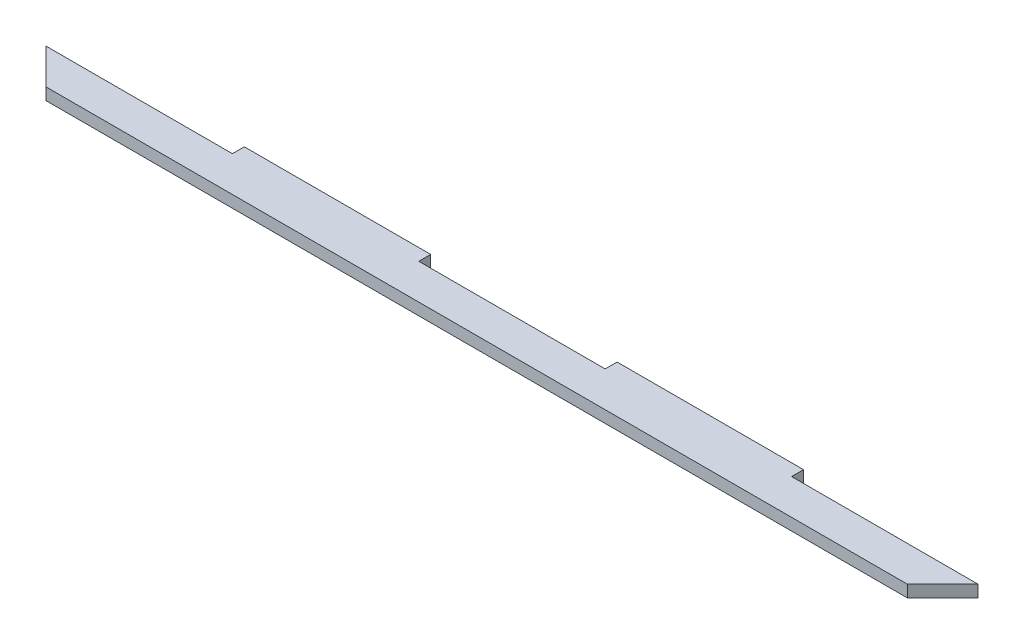
ISO-10303-21;
HEADER;
FILE_DESCRIPTION(('STEP AP214'),'2;1');
FILE_NAME('part.step','',(''),(''),'','','');
FILE_SCHEMA(('AUTOMOTIVE_DESIGN { 1 0 10303 214 1 1 1 1 }'));
ENDSEC;
DATA;
#1=APPLICATION_CONTEXT('core data for automotive mechanical design processes');
#2=APPLICATION_PROTOCOL_DEFINITION('international standard','automotive_design',2000,#1);
#3=PRODUCT_CONTEXT('',#1,'mechanical');
#4=PRODUCT('Part','Part','',(#3));
#5=PRODUCT_RELATED_PRODUCT_CATEGORY('part','',(#4));
#6=PRODUCT_DEFINITION_FORMATION('','',#4);
#7=PRODUCT_DEFINITION_CONTEXT('part definition',#1,'design');
#8=PRODUCT_DEFINITION('design','',#6,#7);
#9=PRODUCT_DEFINITION_SHAPE('','',#8);
#10=(LENGTH_UNIT() NAMED_UNIT(*) SI_UNIT(.MILLI.,.METRE.));
#11=(NAMED_UNIT(*) PLANE_ANGLE_UNIT() SI_UNIT($,.RADIAN.));
#12=(NAMED_UNIT(*) SI_UNIT($,.STERADIAN.) SOLID_ANGLE_UNIT());
#13=UNCERTAINTY_MEASURE_WITH_UNIT(LENGTH_MEASURE(1.E-05),#10,'distance_accuracy_value','');
#14=(GEOMETRIC_REPRESENTATION_CONTEXT(3) GLOBAL_UNCERTAINTY_ASSIGNED_CONTEXT((#13)) GLOBAL_UNIT_ASSIGNED_CONTEXT((#10,
#11,#12)) REPRESENTATION_CONTEXT('',''));
#15=CARTESIAN_POINT('',(0.,0.,0.));
#16=DIRECTION('',(0.,0.,1.));
#17=DIRECTION('',(1.,0.,0.));
#18=AXIS2_PLACEMENT_3D('',#15,#16,#17);
#19=CARTESIAN_POINT('',(5.1686956521739,2.7,-5.43571484255049));
#20=DIRECTION('',(1.,0.,0.));
#21=DIRECTION('',(0.,0.,-1.));
#22=AXIS2_PLACEMENT_3D('',#19,#20,#21);
#23=PLANE('',#22);
#24=DIRECTION('',(0.,0.,1.));
#25=VECTOR('',#24,1.);
#26=CARTESIAN_POINT('',(5.1686956521739,0.,-5.43571484255049));
#27=LINE('',#26,#25);
#28=CARTESIAN_POINT('',(5.1686956521739,0.,-5.43571484255049));
#29=VERTEX_POINT('',#28);
#30=CARTESIAN_POINT('',(5.1686956521739,0.,-2.73571484255049));
#31=VERTEX_POINT('',#30);
#32=EDGE_CURVE('E153',#29,#31,#27,.T.);
#33=ORIENTED_EDGE('',*,*,#32,.T.);
#34=DIRECTION('',(0.,-1.,0.));
#35=VECTOR('',#34,1.);
#36=CARTESIAN_POINT('',(5.1686956521739,2.7,-2.73571484255049));
#37=LINE('',#36,#35);
#38=CARTESIAN_POINT('',(5.1686956521739,2.7,-2.73571484255049));
#39=VERTEX_POINT('',#38);
#40=EDGE_CURVE('E11',#39,#31,#37,.T.);
#41=ORIENTED_EDGE('',*,*,#40,.F.);
#42=DIRECTION('',(0.,0.,1.));
#43=VECTOR('',#42,1.);
#44=CARTESIAN_POINT('',(5.1686956521739,2.7,-5.43571484255049));
#45=LINE('',#44,#43);
#46=CARTESIAN_POINT('',(5.1686956521739,2.7,-5.43571484255049));
#47=VERTEX_POINT('',#46);
#48=EDGE_CURVE('E175',#47,#39,#45,.T.);
#49=ORIENTED_EDGE('',*,*,#48,.F.);
#50=DIRECTION('',(0.,-1.,0.));
#51=VECTOR('',#50,1.);
#52=CARTESIAN_POINT('',(5.1686956521739,2.7,-5.43571484255049));
#53=LINE('',#52,#51);
#54=EDGE_CURVE('E149',#47,#29,#53,.T.);
#55=ORIENTED_EDGE('',*,*,#54,.T.);
#56=EDGE_LOOP('',(#33,#41,#49,#55));
#57=FACE_BOUND('',#56,.T.);
#58=ADVANCED_FACE('F33',(#57),#23,.F.);
#59=CARTESIAN_POINT('',(-37.0313043478261,2.7,-2.73571484255049));
#60=DIRECTION('',(0.,0.,1.));
#61=DIRECTION('',(1.,0.,0.));
#62=AXIS2_PLACEMENT_3D('',#59,#60,#61);
#63=PLANE('',#62);
#64=DIRECTION('',(-1.,0.,0.));
#65=VECTOR('',#64,1.);
#66=CARTESIAN_POINT('',(-37.0313043478261,0.,-2.73571484255049));
#67=LINE('',#66,#65);
#68=CARTESIAN_POINT('',(-37.0313043478261,0.,-2.73571484255049));
#69=VERTEX_POINT('',#68);
#70=EDGE_CURVE('E156',#31,#69,#67,.T.);
#71=ORIENTED_EDGE('',*,*,#70,.T.);
#72=DIRECTION('',(0.,-1.,0.));
#73=VECTOR('',#72,1.);
#74=CARTESIAN_POINT('',(-37.0313043478261,2.7,-2.73571484255049));
#75=LINE('',#74,#73);
#76=CARTESIAN_POINT('',(-37.0313043478261,2.7,-2.73571484255049));
#77=VERTEX_POINT('',#76);
#78=EDGE_CURVE('E41',#77,#69,#75,.T.);
#79=ORIENTED_EDGE('',*,*,#78,.F.);
#80=DIRECTION('',(-1.,0.,0.));
#81=VECTOR('',#80,1.);
#82=CARTESIAN_POINT('',(-37.0313043478261,2.7,-2.73571484255049));
#83=LINE('',#82,#81);
#84=EDGE_CURVE('E104',#39,#77,#83,.T.);
#85=ORIENTED_EDGE('',*,*,#84,.F.);
#86=ORIENTED_EDGE('',*,*,#40,.T.);
#87=EDGE_LOOP('',(#71,#79,#85,#86));
#88=FACE_BOUND('',#87,.T.);
#89=ADVANCED_FACE('F253',(#88),#63,.F.);
#90=CARTESIAN_POINT('',(-37.0313043478261,2.7,-2.73571484255049));
#91=DIRECTION('',(0.707106781186539,0.,-0.707106781186556));
#92=DIRECTION('',(-0.707106781186556,0.,-0.707106781186539));
#93=AXIS2_PLACEMENT_3D('',#90,#91,#92);
#94=PLANE('',#93);
#95=DIRECTION('',(0.707106781186556,0.,0.707106781186539));
#96=VECTOR('',#95,1.);
#97=CARTESIAN_POINT('',(-37.0313043478261,0.,-2.73571484255049));
#98=LINE('',#97,#96);
#99=CARTESIAN_POINT('',(-29.0313043478259,0.,5.26428515744951));
#100=VERTEX_POINT('',#99);
#101=EDGE_CURVE('E158',#69,#100,#98,.T.);
#102=ORIENTED_EDGE('',*,*,#101,.T.);
#103=DIRECTION('',(0.,-1.,0.));
#104=VECTOR('',#103,1.);
#105=CARTESIAN_POINT('',(-29.0313043478259,2.7,5.26428515744951));
#106=LINE('',#105,#104);
#107=CARTESIAN_POINT('',(-29.0313043478259,2.7,5.26428515744951));
#108=VERTEX_POINT('',#107);
#109=EDGE_CURVE('E194',#108,#100,#106,.T.);
#110=ORIENTED_EDGE('',*,*,#109,.F.);
#111=DIRECTION('',(0.707106781186556,0.,0.707106781186539));
#112=VECTOR('',#111,1.);
#113=CARTESIAN_POINT('',(-37.0313043478261,2.7,-2.73571484255049));
#114=LINE('',#113,#112);
#115=EDGE_CURVE('E202',#77,#108,#114,.T.);
#116=ORIENTED_EDGE('',*,*,#115,.F.);
#117=ORIENTED_EDGE('',*,*,#78,.T.);
#118=EDGE_LOOP('',(#102,#110,#116,#117));
#119=FACE_BOUND('',#118,.T.);
#120=ADVANCED_FACE('F200',(#119),#94,.F.);
#121=CARTESIAN_POINT('',(-29.0313043478259,2.7,5.26428515744951));
#122=DIRECTION('',(0.,0.,-1.));
#123=DIRECTION('',(-1.,0.,0.));
#124=AXIS2_PLACEMENT_3D('',#121,#122,#123);
#125=PLANE('',#124);
#126=DIRECTION('',(1.,0.,0.));
#127=VECTOR('',#126,1.);
#128=CARTESIAN_POINT('',(-29.0313043478259,0.,5.26428515744951));
#129=LINE('',#128,#127);
#130=CARTESIAN_POINT('',(165.968695652174,0.,5.26428515744952));
#131=VERTEX_POINT('',#130);
#132=EDGE_CURVE('E160',#100,#131,#129,.T.);
#133=ORIENTED_EDGE('',*,*,#132,.T.);
#134=DIRECTION('',(0.,-1.,0.));
#135=VECTOR('',#134,1.);
#136=CARTESIAN_POINT('',(165.968695652174,2.7,5.26428515744952));
#137=LINE('',#136,#135);
#138=CARTESIAN_POINT('',(165.968695652174,2.7,5.26428515744952));
#139=VERTEX_POINT('',#138);
#140=EDGE_CURVE('E191',#139,#131,#137,.T.);
#141=ORIENTED_EDGE('',*,*,#140,.F.);
#142=DIRECTION('',(1.,0.,0.));
#143=VECTOR('',#142,1.);
#144=CARTESIAN_POINT('',(-29.0313043478259,2.7,5.26428515744951));
#145=LINE('',#144,#143);
#146=EDGE_CURVE('E220',#108,#139,#145,.T.);
#147=ORIENTED_EDGE('',*,*,#146,.F.);
#148=ORIENTED_EDGE('',*,*,#109,.T.);
#149=EDGE_LOOP('',(#133,#141,#147,#148));
#150=FACE_BOUND('',#149,.T.);
#151=ADVANCED_FACE('F211',(#150),#125,.F.);
#152=CARTESIAN_POINT('',(173.968695652174,2.7,-2.73571484255049));
#153=DIRECTION('',(-0.707106781186554,0.,-0.707106781186541));
#154=DIRECTION('',(-0.707106781186541,0.,0.707106781186554));
#155=AXIS2_PLACEMENT_3D('',#152,#153,#154);
#156=PLANE('',#155);
#157=DIRECTION('',(0.707106781186541,0.,-0.707106781186554));
#158=VECTOR('',#157,1.);
#159=CARTESIAN_POINT('',(173.968695652174,0.,-2.73571484255049));
#160=LINE('',#159,#158);
#161=CARTESIAN_POINT('',(173.968695652174,0.,-2.73571484255049));
#162=VERTEX_POINT('',#161);
#163=EDGE_CURVE('E162',#131,#162,#160,.T.);
#164=ORIENTED_EDGE('',*,*,#163,.T.);
#165=DIRECTION('',(0.,-1.,0.));
#166=VECTOR('',#165,1.);
#167=CARTESIAN_POINT('',(173.968695652174,2.7,-2.73571484255049));
#168=LINE('',#167,#166);
#169=CARTESIAN_POINT('',(173.968695652174,2.7,-2.73571484255049));
#170=VERTEX_POINT('',#169);
#171=EDGE_CURVE('E188',#170,#162,#168,.T.);
#172=ORIENTED_EDGE('',*,*,#171,.F.);
#173=DIRECTION('',(0.707106781186541,0.,-0.707106781186554));
#174=VECTOR('',#173,1.);
#175=CARTESIAN_POINT('',(173.968695652174,2.7,-2.73571484255049));
#176=LINE('',#175,#174);
#177=EDGE_CURVE('E217',#139,#170,#176,.T.);
#178=ORIENTED_EDGE('',*,*,#177,.F.);
#179=ORIENTED_EDGE('',*,*,#140,.T.);
#180=EDGE_LOOP('',(#164,#172,#178,#179));
#181=FACE_BOUND('',#180,.T.);
#182=ADVANCED_FACE('F215',(#181),#156,.F.);
#183=CARTESIAN_POINT('',(131.768695652174,2.7,-2.73571484255049));
#184=DIRECTION('',(0.,0.,1.));
#185=DIRECTION('',(1.,0.,0.));
#186=AXIS2_PLACEMENT_3D('',#183,#184,#185);
#187=PLANE('',#186);
#188=DIRECTION('',(-1.,0.,0.));
#189=VECTOR('',#188,1.);
#190=CARTESIAN_POINT('',(131.768695652174,0.,-2.73571484255049));
#191=LINE('',#190,#189);
#192=CARTESIAN_POINT('',(131.768695652174,0.,-2.73571484255049));
#193=VERTEX_POINT('',#192);
#194=EDGE_CURVE('E164',#162,#193,#191,.T.);
#195=ORIENTED_EDGE('',*,*,#194,.T.);
#196=DIRECTION('',(0.,-1.,0.));
#197=VECTOR('',#196,1.);
#198=CARTESIAN_POINT('',(131.768695652174,2.7,-2.73571484255049));
#199=LINE('',#198,#197);
#200=CARTESIAN_POINT('',(131.768695652174,2.7,-2.73571484255049));
#201=VERTEX_POINT('',#200);
#202=EDGE_CURVE('E185',#201,#193,#199,.T.);
#203=ORIENTED_EDGE('',*,*,#202,.F.);
#204=DIRECTION('',(-1.,0.,0.));
#205=VECTOR('',#204,1.);
#206=CARTESIAN_POINT('',(131.768695652174,2.7,-2.73571484255049));
#207=LINE('',#206,#205);
#208=EDGE_CURVE('E219',#170,#201,#207,.T.);
#209=ORIENTED_EDGE('',*,*,#208,.F.);
#210=ORIENTED_EDGE('',*,*,#171,.T.);
#211=EDGE_LOOP('',(#195,#203,#209,#210));
#212=FACE_BOUND('',#211,.T.);
#213=ADVANCED_FACE('F266',(#212),#187,.F.);
#214=CARTESIAN_POINT('',(131.768695652174,2.7,-5.43571484255049));
#215=DIRECTION('',(-1.,0.,0.));
#216=DIRECTION('',(0.,0.,1.));
#217=AXIS2_PLACEMENT_3D('',#214,#215,#216);
#218=PLANE('',#217);
#219=DIRECTION('',(0.,0.,-1.));
#220=VECTOR('',#219,1.);
#221=CARTESIAN_POINT('',(131.768695652174,0.,-5.43571484255049));
#222=LINE('',#221,#220);
#223=CARTESIAN_POINT('',(131.768695652174,0.,-5.43571484255049));
#224=VERTEX_POINT('',#223);
#225=EDGE_CURVE('E166',#193,#224,#222,.T.);
#226=ORIENTED_EDGE('',*,*,#225,.T.);
#227=DIRECTION('',(0.,-1.,0.));
#228=VECTOR('',#227,1.);
#229=CARTESIAN_POINT('',(131.768695652174,2.7,-5.43571484255049));
#230=LINE('',#229,#228);
#231=CARTESIAN_POINT('',(131.768695652174,2.7,-5.43571484255049));
#232=VERTEX_POINT('',#231);
#233=EDGE_CURVE('E182',#232,#224,#230,.T.);
#234=ORIENTED_EDGE('',*,*,#233,.F.);
#235=DIRECTION('',(0.,0.,-1.));
#236=VECTOR('',#235,1.);
#237=CARTESIAN_POINT('',(131.768695652174,2.7,-5.43571484255049));
#238=LINE('',#237,#236);
#239=EDGE_CURVE('E222',#201,#232,#238,.T.);
#240=ORIENTED_EDGE('',*,*,#239,.F.);
#241=ORIENTED_EDGE('',*,*,#202,.T.);
#242=EDGE_LOOP('',(#226,#234,#240,#241));
#243=FACE_BOUND('',#242,.T.);
#244=ADVANCED_FACE('F269',(#243),#218,.F.);
#245=CARTESIAN_POINT('',(89.5686956521739,2.7,-5.43571484255049));
#246=DIRECTION('',(0.,0.,1.));
#247=DIRECTION('',(1.,0.,0.));
#248=AXIS2_PLACEMENT_3D('',#245,#246,#247);
#249=PLANE('',#248);
#250=DIRECTION('',(-1.,0.,0.));
#251=VECTOR('',#250,1.);
#252=CARTESIAN_POINT('',(89.5686956521739,0.,-5.43571484255049));
#253=LINE('',#252,#251);
#254=CARTESIAN_POINT('',(89.5686956521739,0.,-5.43571484255049));
#255=VERTEX_POINT('',#254);
#256=EDGE_CURVE('E168',#224,#255,#253,.T.);
#257=ORIENTED_EDGE('',*,*,#256,.T.);
#258=DIRECTION('',(0.,-1.,0.));
#259=VECTOR('',#258,1.);
#260=CARTESIAN_POINT('',(89.5686956521739,2.7,-5.43571484255049));
#261=LINE('',#260,#259);
#262=CARTESIAN_POINT('',(89.5686956521739,2.7,-5.43571484255049));
#263=VERTEX_POINT('',#262);
#264=EDGE_CURVE('E179',#263,#255,#261,.T.);
#265=ORIENTED_EDGE('',*,*,#264,.F.);
#266=DIRECTION('',(-1.,0.,0.));
#267=VECTOR('',#266,1.);
#268=CARTESIAN_POINT('',(89.5686956521739,2.7,-5.43571484255049));
#269=LINE('',#268,#267);
#270=EDGE_CURVE('E228',#232,#263,#269,.T.);
#271=ORIENTED_EDGE('',*,*,#270,.F.);
#272=ORIENTED_EDGE('',*,*,#233,.T.);
#273=EDGE_LOOP('',(#257,#265,#271,#272));
#274=FACE_BOUND('',#273,.T.);
#275=ADVANCED_FACE('F234',(#274),#249,.F.);
#276=CARTESIAN_POINT('',(89.5686956521739,2.7,-5.43571484255049));
#277=DIRECTION('',(1.,0.,0.));
#278=DIRECTION('',(0.,0.,-1.));
#279=AXIS2_PLACEMENT_3D('',#276,#277,#278);
#280=PLANE('',#279);
#281=DIRECTION('',(0.,0.,1.));
#282=VECTOR('',#281,1.);
#283=CARTESIAN_POINT('',(89.5686956521739,0.,-5.43571484255049));
#284=LINE('',#283,#282);
#285=CARTESIAN_POINT('',(89.5686956521739,0.,-2.73571484255049));
#286=VERTEX_POINT('',#285);
#287=EDGE_CURVE('E170',#255,#286,#284,.T.);
#288=ORIENTED_EDGE('',*,*,#287,.T.);
#289=DIRECTION('',(0.,-1.,0.));
#290=VECTOR('',#289,1.);
#291=CARTESIAN_POINT('',(89.5686956521739,2.7,-2.73571484255049));
#292=LINE('',#291,#290);
#293=CARTESIAN_POINT('',(89.5686956521739,2.7,-2.73571484255049));
#294=VERTEX_POINT('',#293);
#295=EDGE_CURVE('E144',#294,#286,#292,.T.);
#296=ORIENTED_EDGE('',*,*,#295,.F.);
#297=DIRECTION('',(0.,0.,1.));
#298=VECTOR('',#297,1.);
#299=CARTESIAN_POINT('',(89.5686956521739,2.7,-5.43571484255049));
#300=LINE('',#299,#298);
#301=EDGE_CURVE('E135',#263,#294,#300,.T.);
#302=ORIENTED_EDGE('',*,*,#301,.F.);
#303=ORIENTED_EDGE('',*,*,#264,.T.);
#304=EDGE_LOOP('',(#288,#296,#302,#303));
#305=FACE_BOUND('',#304,.T.);
#306=ADVANCED_FACE('F238',(#305),#280,.F.);
#307=CARTESIAN_POINT('',(47.3686956521739,2.7,-2.73571484255049));
#308=DIRECTION('',(0.,0.,1.));
#309=DIRECTION('',(1.,0.,0.));
#310=AXIS2_PLACEMENT_3D('',#307,#308,#309);
#311=PLANE('',#310);
#312=DIRECTION('',(-1.,0.,0.));
#313=VECTOR('',#312,1.);
#314=CARTESIAN_POINT('',(47.3686956521739,0.,-2.73571484255049));
#315=LINE('',#314,#313);
#316=CARTESIAN_POINT('',(47.3686956521739,0.,-2.73571484255049));
#317=VERTEX_POINT('',#316);
#318=EDGE_CURVE('E143',#286,#317,#315,.T.);
#319=ORIENTED_EDGE('',*,*,#318,.T.);
#320=DIRECTION('',(0.,-1.,0.));
#321=VECTOR('',#320,1.);
#322=CARTESIAN_POINT('',(47.3686956521739,2.7,-2.73571484255049));
#323=LINE('',#322,#321);
#324=CARTESIAN_POINT('',(47.3686956521739,2.7,-2.73571484255049));
#325=VERTEX_POINT('',#324);
#326=EDGE_CURVE('E140',#325,#317,#323,.T.);
#327=ORIENTED_EDGE('',*,*,#326,.F.);
#328=DIRECTION('',(-1.,0.,0.));
#329=VECTOR('',#328,1.);
#330=CARTESIAN_POINT('',(47.3686956521739,2.7,-2.73571484255049));
#331=LINE('',#330,#329);
#332=EDGE_CURVE('E129',#294,#325,#331,.T.);
#333=ORIENTED_EDGE('',*,*,#332,.F.);
#334=ORIENTED_EDGE('',*,*,#295,.T.);
#335=EDGE_LOOP('',(#319,#327,#333,#334));
#336=FACE_BOUND('',#335,.T.);
#337=ADVANCED_FACE('F141',(#336),#311,.F.);
#338=CARTESIAN_POINT('',(47.3686956521739,2.7,-5.43571484255049));
#339=DIRECTION('',(-1.,0.,0.));
#340=DIRECTION('',(0.,0.,1.));
#341=AXIS2_PLACEMENT_3D('',#338,#339,#340);
#342=PLANE('',#341);
#343=DIRECTION('',(0.,0.,-1.));
#344=VECTOR('',#343,1.);
#345=CARTESIAN_POINT('',(47.3686956521739,0.,-5.43571484255049));
#346=LINE('',#345,#344);
#347=CARTESIAN_POINT('',(47.3686956521739,0.,-5.43571484255049));
#348=VERTEX_POINT('',#347);
#349=EDGE_CURVE('E90',#317,#348,#346,.T.);
#350=ORIENTED_EDGE('',*,*,#349,.T.);
#351=DIRECTION('',(0.,-1.,0.));
#352=VECTOR('',#351,1.);
#353=CARTESIAN_POINT('',(47.3686956521739,2.7,-5.43571484255049));
#354=LINE('',#353,#352);
#355=CARTESIAN_POINT('',(47.3686956521739,2.7,-5.43571484255049));
#356=VERTEX_POINT('',#355);
#357=EDGE_CURVE('E145',#356,#348,#354,.T.);
#358=ORIENTED_EDGE('',*,*,#357,.F.);
#359=DIRECTION('',(0.,0.,-1.));
#360=VECTOR('',#359,1.);
#361=CARTESIAN_POINT('',(47.3686956521739,2.7,-5.43571484255049));
#362=LINE('',#361,#360);
#363=EDGE_CURVE('E133',#325,#356,#362,.T.);
#364=ORIENTED_EDGE('',*,*,#363,.F.);
#365=ORIENTED_EDGE('',*,*,#326,.T.);
#366=EDGE_LOOP('',(#350,#358,#364,#365));
#367=FACE_BOUND('',#366,.T.);
#368=ADVANCED_FACE('F147',(#367),#342,.F.);
#369=CARTESIAN_POINT('',(5.1686956521739,2.7,-5.43571484255049));
#370=DIRECTION('',(0.,0.,1.));
#371=DIRECTION('',(1.,0.,0.));
#372=AXIS2_PLACEMENT_3D('',#369,#370,#371);
#373=PLANE('',#372);
#374=DIRECTION('',(-1.,0.,0.));
#375=VECTOR('',#374,1.);
#376=CARTESIAN_POINT('',(5.1686956521739,0.,-5.43571484255049));
#377=LINE('',#376,#375);
#378=EDGE_CURVE('E96',#348,#29,#377,.T.);
#379=ORIENTED_EDGE('',*,*,#378,.T.);
#380=ORIENTED_EDGE('',*,*,#54,.F.);
#381=DIRECTION('',(-1.,0.,0.));
#382=VECTOR('',#381,1.);
#383=CARTESIAN_POINT('',(5.1686956521739,2.7,-5.43571484255049));
#384=LINE('',#383,#382);
#385=EDGE_CURVE('E49',#356,#47,#384,.T.);
#386=ORIENTED_EDGE('',*,*,#385,.F.);
#387=ORIENTED_EDGE('',*,*,#357,.T.);
#388=EDGE_LOOP('',(#379,#380,#386,#387));
#389=FACE_BOUND('',#388,.T.);
#390=ADVANCED_FACE('F242',(#389),#373,.F.);
#391=CARTESIAN_POINT('',(0.,2.7,0.));
#392=DIRECTION('',(0.,1.,0.));
#393=DIRECTION('',(0.,0.,1.));
#394=AXIS2_PLACEMENT_3D('',#391,#392,#393);
#395=PLANE('',#394);
#396=ORIENTED_EDGE('',*,*,#48,.T.);
#397=ORIENTED_EDGE('',*,*,#84,.T.);
#398=ORIENTED_EDGE('',*,*,#115,.T.);
#399=ORIENTED_EDGE('',*,*,#146,.T.);
#400=ORIENTED_EDGE('',*,*,#177,.T.);
#401=ORIENTED_EDGE('',*,*,#208,.T.);
#402=ORIENTED_EDGE('',*,*,#239,.T.);
#403=ORIENTED_EDGE('',*,*,#270,.T.);
#404=ORIENTED_EDGE('',*,*,#301,.T.);
#405=ORIENTED_EDGE('',*,*,#332,.T.);
#406=ORIENTED_EDGE('',*,*,#363,.T.);
#407=ORIENTED_EDGE('',*,*,#385,.T.);
#408=EDGE_LOOP('',(#396,#397,#398,#399,#400,#401,#402,#403,#404,#405,#406,#407));
#409=FACE_BOUND('',#408,.T.);
#410=ADVANCED_FACE('F131',(#409),#395,.T.);
#411=CARTESIAN_POINT('',(0.,0.,0.));
#412=DIRECTION('',(0.,1.,0.));
#413=DIRECTION('',(0.,0.,1.));
#414=AXIS2_PLACEMENT_3D('',#411,#412,#413);
#415=PLANE('',#414);
#416=ORIENTED_EDGE('',*,*,#32,.F.);
#417=ORIENTED_EDGE('',*,*,#378,.F.);
#418=ORIENTED_EDGE('',*,*,#349,.F.);
#419=ORIENTED_EDGE('',*,*,#318,.F.);
#420=ORIENTED_EDGE('',*,*,#287,.F.);
#421=ORIENTED_EDGE('',*,*,#256,.F.);
#422=ORIENTED_EDGE('',*,*,#225,.F.);
#423=ORIENTED_EDGE('',*,*,#194,.F.);
#424=ORIENTED_EDGE('',*,*,#163,.F.);
#425=ORIENTED_EDGE('',*,*,#132,.F.);
#426=ORIENTED_EDGE('',*,*,#101,.F.);
#427=ORIENTED_EDGE('',*,*,#70,.F.);
#428=EDGE_LOOP('',(#416,#417,#418,#419,#420,#421,#422,#423,#424,#425,#426,#427));
#429=FACE_BOUND('',#428,.T.);
#430=ADVANCED_FACE('F206',(#429),#415,.F.);
#431=CLOSED_SHELL('',(#58,#89,#120,#151,#182,#213,#244,#275,#306,#337,#368,#390,#410,#430));
#432=MANIFOLD_SOLID_BREP('B2',#431);
#433=ADVANCED_BREP_SHAPE_REPRESENTATION('',(#18,#432),#14);
#434=SHAPE_DEFINITION_REPRESENTATION(#9,#433);
ENDSEC;
END-ISO-10303-21;
